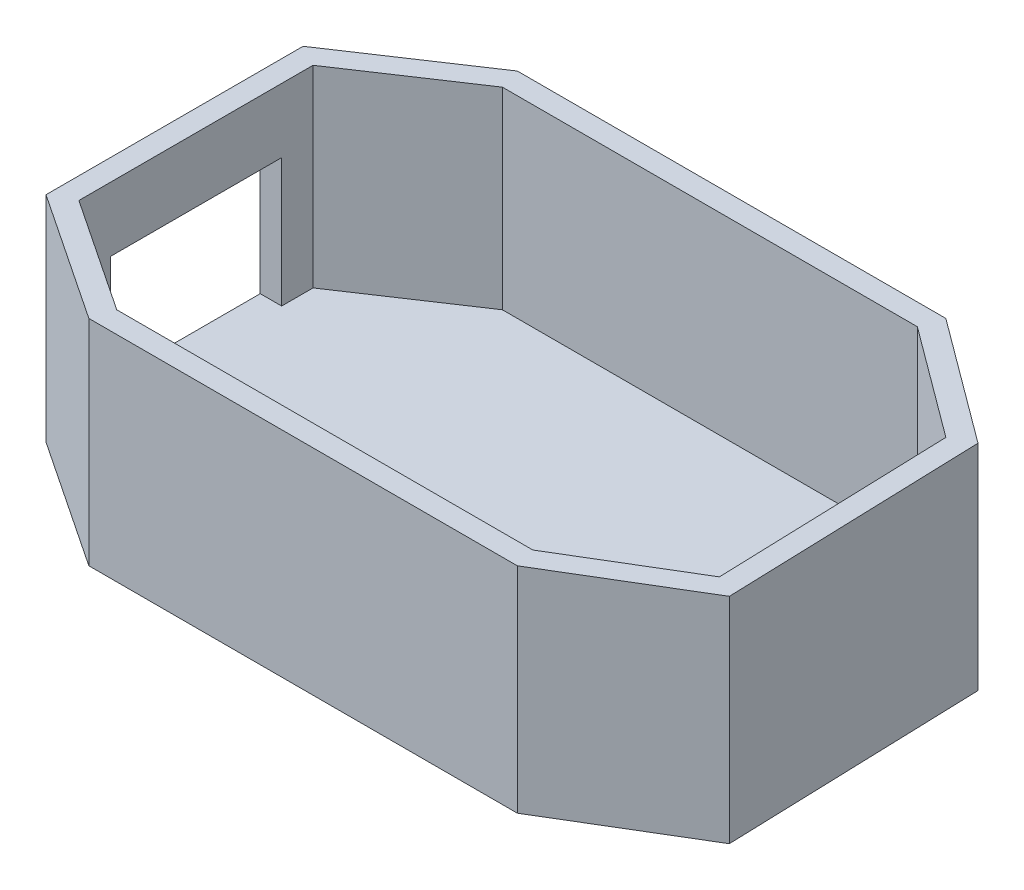
ISO-10303-21;
HEADER;
FILE_DESCRIPTION(('STEP AP214'),'2;1');
FILE_NAME('part.step','',(''),(''),'','','');
FILE_SCHEMA(('AUTOMOTIVE_DESIGN { 1 0 10303 214 1 1 1 1 }'));
ENDSEC;
DATA;
#1=APPLICATION_CONTEXT('core data for automotive mechanical design processes');
#2=APPLICATION_PROTOCOL_DEFINITION('international standard','automotive_design',2000,#1);
#3=PRODUCT_CONTEXT('',#1,'mechanical');
#4=PRODUCT('Part','Part','',(#3));
#5=PRODUCT_RELATED_PRODUCT_CATEGORY('part','',(#4));
#6=PRODUCT_DEFINITION_FORMATION('','',#4);
#7=PRODUCT_DEFINITION_CONTEXT('part definition',#1,'design');
#8=PRODUCT_DEFINITION('design','',#6,#7);
#9=PRODUCT_DEFINITION_SHAPE('','',#8);
#10=(LENGTH_UNIT() NAMED_UNIT(*) SI_UNIT(.MILLI.,.METRE.));
#11=(NAMED_UNIT(*) PLANE_ANGLE_UNIT() SI_UNIT($,.RADIAN.));
#12=(NAMED_UNIT(*) SI_UNIT($,.STERADIAN.) SOLID_ANGLE_UNIT());
#13=UNCERTAINTY_MEASURE_WITH_UNIT(LENGTH_MEASURE(1.E-05),#10,'distance_accuracy_value','');
#14=(GEOMETRIC_REPRESENTATION_CONTEXT(3) GLOBAL_UNCERTAINTY_ASSIGNED_CONTEXT((#13)) GLOBAL_UNIT_ASSIGNED_CONTEXT((#10,
#11,#12)) REPRESENTATION_CONTEXT('',''));
#15=CARTESIAN_POINT('',(0.,0.,0.));
#16=DIRECTION('',(0.,0.,1.));
#17=DIRECTION('',(1.,0.,0.));
#18=AXIS2_PLACEMENT_3D('',#15,#16,#17);
#19=CARTESIAN_POINT('',(0.,50.,0.));
#20=DIRECTION('',(0.,-1.,0.));
#21=DIRECTION('',(0.,0.,-1.));
#22=AXIS2_PLACEMENT_3D('',#19,#20,#21);
#23=PLANE('',#22);
#24=DIRECTION('',(-0.832050294337843,0.,0.55470019622523));
#25=VECTOR('',#24,1.);
#26=CARTESIAN_POINT('',(-60.,50.,-40.));
#27=LINE('',#26,#25);
#28=CARTESIAN_POINT('',(-60.,50.,-40.));
#29=VERTEX_POINT('',#28);
#30=CARTESIAN_POINT('',(-90.,50.,-20.));
#31=VERTEX_POINT('',#30);
#32=EDGE_CURVE('E268',#29,#31,#27,.T.);
#33=ORIENTED_EDGE('',*,*,#32,.T.);
#34=DIRECTION('',(0.,0.,1.));
#35=VECTOR('',#34,1.);
#36=CARTESIAN_POINT('',(-90.,50.,-20.));
#37=LINE('',#36,#35);
#38=CARTESIAN_POINT('',(-90.,50.,40.));
#39=VERTEX_POINT('',#38);
#40=EDGE_CURVE('E271',#31,#39,#37,.T.);
#41=ORIENTED_EDGE('',*,*,#40,.T.);
#42=DIRECTION('',(0.832050294337843,0.,0.554700196225229));
#43=VECTOR('',#42,1.);
#44=CARTESIAN_POINT('',(-90.,50.,40.));
#45=LINE('',#44,#43);
#46=CARTESIAN_POINT('',(-60.,50.,60.));
#47=VERTEX_POINT('',#46);
#48=EDGE_CURVE('E274',#39,#47,#45,.T.);
#49=ORIENTED_EDGE('',*,*,#48,.T.);
#50=DIRECTION('',(1.,0.,0.));
#51=VECTOR('',#50,1.);
#52=CARTESIAN_POINT('',(-60.,50.,60.));
#53=LINE('',#52,#51);
#54=CARTESIAN_POINT('',(40.,50.,60.));
#55=VERTEX_POINT('',#54);
#56=EDGE_CURVE('E276',#47,#55,#53,.T.);
#57=ORIENTED_EDGE('',*,*,#56,.T.);
#58=DIRECTION('',(0.857204895939187,0.,-0.514975500755024));
#59=VECTOR('',#58,1.);
#60=CARTESIAN_POINT('',(40.,50.,60.));
#61=LINE('',#60,#59);
#62=CARTESIAN_POINT('',(70.9069620588752,50.,41.4322942642002));
#63=VERTEX_POINT('',#62);
#64=EDGE_CURVE('E278',#55,#63,#61,.T.);
#65=ORIENTED_EDGE('',*,*,#64,.T.);
#66=DIRECTION('',(-0.0322666793552478,0.,-0.999479295134915));
#67=VECTOR('',#66,1.);
#68=CARTESIAN_POINT('',(70.9069620588752,50.,41.4322942642002));
#69=LINE('',#68,#67);
#70=CARTESIAN_POINT('',(68.9709612975603,50.,-18.5364634438947));
#71=VERTEX_POINT('',#70);
#72=EDGE_CURVE('E280',#63,#71,#69,.T.);
#73=ORIENTED_EDGE('',*,*,#72,.T.);
#74=DIRECTION('',(-0.80350989582951,0.,-0.595291396967947));
#75=VECTOR('',#74,1.);
#76=CARTESIAN_POINT('',(68.9709612975603,50.,-18.5364634438947));
#77=LINE('',#76,#75);
#78=CARTESIAN_POINT('',(40.,50.,-40.));
#79=VERTEX_POINT('',#78);
#80=EDGE_CURVE('E282',#71,#79,#77,.T.);
#81=ORIENTED_EDGE('',*,*,#80,.T.);
#82=DIRECTION('',(1.,0.,0.));
#83=VECTOR('',#82,1.);
#84=CARTESIAN_POINT('',(-60.,50.,-40.));
#85=LINE('',#84,#83);
#86=EDGE_CURVE('E284',#29,#79,#85,.T.);
#87=ORIENTED_EDGE('',*,*,#86,.F.);
#88=EDGE_LOOP('',(#33,#41,#49,#57,#65,#73,#81,#87));
#89=FACE_BOUND('',#88,.T.);
#90=DIRECTION('',(-0.832050294337843,0.,0.55470019622523));
#91=VECTOR('',#90,1.);
#92=CARTESIAN_POINT('',(-34.1495759419508,50.,-51.2243639129262));
#93=LINE('',#92,#91);
#94=CARTESIAN_POINT('',(-58.4861218113401,50.,-35.));
#95=VERTEX_POINT('',#94);
#96=CARTESIAN_POINT('',(-85.,50.,-17.32408120756));
#97=VERTEX_POINT('',#96);
#98=EDGE_CURVE('E251',#95,#97,#93,.T.);
#99=ORIENTED_EDGE('',*,*,#98,.F.);
#100=DIRECTION('',(1.,0.,0.));
#101=VECTOR('',#100,1.);
#102=CARTESIAN_POINT('',(0.,50.,-35.));
#103=LINE('',#102,#101);
#104=CARTESIAN_POINT('',(38.3496309104138,50.,-35.));
#105=VERTEX_POINT('',#104);
#106=EDGE_CURVE('E219',#95,#105,#103,.T.);
#107=ORIENTED_EDGE('',*,*,#106,.T.);
#108=DIRECTION('',(-0.80350989582951,0.,-0.595291396967947));
#109=VECTOR('',#108,1.);
#110=CARTESIAN_POINT('',(30.331318041959,50.,-40.9404777633272));
#111=LINE('',#110,#109);
#112=CARTESIAN_POINT('',(64.0515868776399,50.,-15.9583511641217));
#113=VERTEX_POINT('',#112);
#114=EDGE_CURVE('E263',#113,#105,#111,.T.);
#115=ORIENTED_EDGE('',*,*,#114,.F.);
#116=DIRECTION('',(-0.0322666793552478,0.,-0.999479295134915));
#117=VECTOR('',#116,1.);
#118=CARTESIAN_POINT('',(64.4995551755071,50.,-2.08227071389535));
#119=LINE('',#118,#117);
#120=CARTESIAN_POINT('',(65.8148110411914,50.,38.6585502141933));
#121=VERTEX_POINT('',#120);
#122=EDGE_CURVE('E261',#121,#113,#119,.T.);
#123=ORIENTED_EDGE('',*,*,#122,.F.);
#124=DIRECTION('',(0.857204895939187,0.,-0.514975500755024));
#125=VECTOR('',#124,1.);
#126=CARTESIAN_POINT('',(34.5194843834969,50.,57.4595703590685));
#127=LINE('',#126,#125);
#128=CARTESIAN_POINT('',(38.6135738122352,50.,55.));
#129=VERTEX_POINT('',#128);
#130=EDGE_CURVE('E259',#129,#121,#127,.T.);
#131=ORIENTED_EDGE('',*,*,#130,.F.);
#132=DIRECTION('',(1.,0.,0.));
#133=VECTOR('',#132,1.);
#134=CARTESIAN_POINT('',(0.,50.,55.));
#135=LINE('',#134,#133);
#136=CARTESIAN_POINT('',(-58.4861218113401,50.,55.));
#137=VERTEX_POINT('',#136);
#138=EDGE_CURVE('E257',#137,#129,#135,.T.);
#139=ORIENTED_EDGE('',*,*,#138,.F.);
#140=DIRECTION('',(0.832050294337844,0.,0.554700196225229));
#141=VECTOR('',#140,1.);
#142=CARTESIAN_POINT('',(-43.38034517272,50.,65.07051775908));
#143=LINE('',#142,#141);
#144=CARTESIAN_POINT('',(-85.,50.,37.32408120756));
#145=VERTEX_POINT('',#144);
#146=EDGE_CURVE('E255',#145,#137,#143,.T.);
#147=ORIENTED_EDGE('',*,*,#146,.F.);
#148=DIRECTION('',(0.,0.,1.));
#149=VECTOR('',#148,1.);
#150=CARTESIAN_POINT('',(-85.,50.,0.));
#151=LINE('',#150,#149);
#152=EDGE_CURVE('E253',#97,#145,#151,.T.);
#153=ORIENTED_EDGE('',*,*,#152,.F.);
#154=EDGE_LOOP('',(#99,#107,#115,#123,#131,#139,#147,#153));
#155=FACE_BOUND('',#154,.T.);
#156=ADVANCED_FACE('F35',(#89,#155),#23,.F.);
#157=CARTESIAN_POINT('',(-60.,50.,-40.));
#158=DIRECTION('',(0.55470019622523,0.,0.832050294337843));
#159=DIRECTION('',(0.832050294337843,0.,-0.55470019622523));
#160=AXIS2_PLACEMENT_3D('',#157,#158,#159);
#161=PLANE('',#160);
#162=DIRECTION('',(-0.832050294337843,0.,0.55470019622523));
#163=VECTOR('',#162,1.);
#164=CARTESIAN_POINT('',(-60.,0.,-40.));
#165=LINE('',#164,#163);
#166=CARTESIAN_POINT('',(-60.,0.,-40.));
#167=VERTEX_POINT('',#166);
#168=CARTESIAN_POINT('',(-90.,0.,-20.));
#169=VERTEX_POINT('',#168);
#170=EDGE_CURVE('E214',#167,#169,#165,.T.);
#171=ORIENTED_EDGE('',*,*,#170,.T.);
#172=DIRECTION('',(0.,-1.,0.));
#173=VECTOR('',#172,1.);
#174=CARTESIAN_POINT('',(-90.,50.,-20.));
#175=LINE('',#174,#173);
#176=EDGE_CURVE('E11',#31,#169,#175,.T.);
#177=ORIENTED_EDGE('',*,*,#176,.F.);
#178=ORIENTED_EDGE('',*,*,#32,.F.);
#179=DIRECTION('',(0.,-1.,0.));
#180=VECTOR('',#179,1.);
#181=CARTESIAN_POINT('',(-60.,50.,-40.));
#182=LINE('',#181,#180);
#183=EDGE_CURVE('E287',#29,#167,#182,.T.);
#184=ORIENTED_EDGE('',*,*,#183,.T.);
#185=EDGE_LOOP('',(#171,#177,#178,#184));
#186=FACE_BOUND('',#185,.T.);
#187=ADVANCED_FACE('F37',(#186),#161,.F.);
#188=CARTESIAN_POINT('',(-90.,50.,-20.));
#189=DIRECTION('',(1.,0.,0.));
#190=DIRECTION('',(0.,0.,-1.));
#191=AXIS2_PLACEMENT_3D('',#188,#189,#190);
#192=PLANE('',#191);
#193=DIRECTION('',(0.,0.,-1.));
#194=VECTOR('',#193,1.);
#195=CARTESIAN_POINT('',(-90.,35.,-9.99999999999999));
#196=LINE('',#195,#194);
#197=CARTESIAN_POINT('',(-90.,35.,30.));
#198=VERTEX_POINT('',#197);
#199=CARTESIAN_POINT('',(-90.,35.,-9.99999999999999));
#200=VERTEX_POINT('',#199);
#201=EDGE_CURVE('E187',#198,#200,#196,.T.);
#202=ORIENTED_EDGE('',*,*,#201,.F.);
#203=DIRECTION('',(0.,1.,0.));
#204=VECTOR('',#203,1.);
#205=CARTESIAN_POINT('',(-90.,35.,30.));
#206=LINE('',#205,#204);
#207=CARTESIAN_POINT('',(-90.,5.,30.));
#208=VERTEX_POINT('',#207);
#209=EDGE_CURVE('E50',#208,#198,#206,.T.);
#210=ORIENTED_EDGE('',*,*,#209,.F.);
#211=DIRECTION('',(0.,0.,1.));
#212=VECTOR('',#211,1.);
#213=CARTESIAN_POINT('',(-90.,5.00000000000001,-9.99999999999998));
#214=LINE('',#213,#212);
#215=CARTESIAN_POINT('',(-90.,5.00000000000001,-9.99999999999998));
#216=VERTEX_POINT('',#215);
#217=EDGE_CURVE('E197',#216,#208,#214,.T.);
#218=ORIENTED_EDGE('',*,*,#217,.F.);
#219=DIRECTION('',(0.,-1.,0.));
#220=VECTOR('',#219,1.);
#221=CARTESIAN_POINT('',(-90.,35.,-9.99999999999999));
#222=LINE('',#221,#220);
#223=EDGE_CURVE('E200',#200,#216,#222,.T.);
#224=ORIENTED_EDGE('',*,*,#223,.F.);
#225=EDGE_LOOP('',(#202,#210,#218,#224));
#226=FACE_BOUND('',#225,.T.);
#227=DIRECTION('',(0.,0.,1.));
#228=VECTOR('',#227,1.);
#229=CARTESIAN_POINT('',(-90.,0.,-20.));
#230=LINE('',#229,#228);
#231=CARTESIAN_POINT('',(-90.,0.,40.));
#232=VERTEX_POINT('',#231);
#233=EDGE_CURVE('E290',#169,#232,#230,.T.);
#234=ORIENTED_EDGE('',*,*,#233,.T.);
#235=DIRECTION('',(0.,-1.,0.));
#236=VECTOR('',#235,1.);
#237=CARTESIAN_POINT('',(-90.,50.,40.));
#238=LINE('',#237,#236);
#239=EDGE_CURVE('E43',#39,#232,#238,.T.);
#240=ORIENTED_EDGE('',*,*,#239,.F.);
#241=ORIENTED_EDGE('',*,*,#40,.F.);
#242=ORIENTED_EDGE('',*,*,#176,.T.);
#243=EDGE_LOOP('',(#234,#240,#241,#242));
#244=FACE_BOUND('',#243,.T.);
#245=ADVANCED_FACE('F348',(#226,#244),#192,.F.);
#246=CARTESIAN_POINT('',(-90.,50.,40.));
#247=DIRECTION('',(0.554700196225229,0.,-0.832050294337843));
#248=DIRECTION('',(-0.832050294337844,0.,-0.554700196225229));
#249=AXIS2_PLACEMENT_3D('',#246,#247,#248);
#250=PLANE('',#249);
#251=DIRECTION('',(0.832050294337843,0.,0.554700196225229));
#252=VECTOR('',#251,1.);
#253=CARTESIAN_POINT('',(-90.,0.,40.));
#254=LINE('',#253,#252);
#255=CARTESIAN_POINT('',(-60.,0.,60.));
#256=VERTEX_POINT('',#255);
#257=EDGE_CURVE('E292',#232,#256,#254,.T.);
#258=ORIENTED_EDGE('',*,*,#257,.T.);
#259=DIRECTION('',(0.,-1.,0.));
#260=VECTOR('',#259,1.);
#261=CARTESIAN_POINT('',(-60.,50.,60.));
#262=LINE('',#261,#260);
#263=EDGE_CURVE('E317',#47,#256,#262,.T.);
#264=ORIENTED_EDGE('',*,*,#263,.F.);
#265=ORIENTED_EDGE('',*,*,#48,.F.);
#266=ORIENTED_EDGE('',*,*,#239,.T.);
#267=EDGE_LOOP('',(#258,#264,#265,#266));
#268=FACE_BOUND('',#267,.T.);
#269=ADVANCED_FACE('F324',(#268),#250,.F.);
#270=CARTESIAN_POINT('',(-60.,50.,60.));
#271=DIRECTION('',(0.,0.,-1.));
#272=DIRECTION('',(-1.,0.,0.));
#273=AXIS2_PLACEMENT_3D('',#270,#271,#272);
#274=PLANE('',#273);
#275=DIRECTION('',(1.,0.,0.));
#276=VECTOR('',#275,1.);
#277=CARTESIAN_POINT('',(-60.,0.,60.));
#278=LINE('',#277,#276);
#279=CARTESIAN_POINT('',(40.,0.,60.));
#280=VERTEX_POINT('',#279);
#281=EDGE_CURVE('E294',#256,#280,#278,.T.);
#282=ORIENTED_EDGE('',*,*,#281,.T.);
#283=DIRECTION('',(0.,-1.,0.));
#284=VECTOR('',#283,1.);
#285=CARTESIAN_POINT('',(40.,50.,60.));
#286=LINE('',#285,#284);
#287=EDGE_CURVE('E314',#55,#280,#286,.T.);
#288=ORIENTED_EDGE('',*,*,#287,.F.);
#289=ORIENTED_EDGE('',*,*,#56,.F.);
#290=ORIENTED_EDGE('',*,*,#263,.T.);
#291=EDGE_LOOP('',(#282,#288,#289,#290));
#292=FACE_BOUND('',#291,.T.);
#293=ADVANCED_FACE('F335',(#292),#274,.F.);
#294=CARTESIAN_POINT('',(40.,50.,60.));
#295=DIRECTION('',(-0.514975500755024,0.,-0.857204895939187));
#296=DIRECTION('',(-0.857204895939187,0.,0.514975500755024));
#297=AXIS2_PLACEMENT_3D('',#294,#295,#296);
#298=PLANE('',#297);
#299=DIRECTION('',(0.857204895939187,0.,-0.514975500755024));
#300=VECTOR('',#299,1.);
#301=CARTESIAN_POINT('',(40.,0.,60.));
#302=LINE('',#301,#300);
#303=CARTESIAN_POINT('',(70.9069620588752,0.,41.4322942642002));
#304=VERTEX_POINT('',#303);
#305=EDGE_CURVE('E296',#280,#304,#302,.T.);
#306=ORIENTED_EDGE('',*,*,#305,.T.);
#307=DIRECTION('',(0.,-1.,0.));
#308=VECTOR('',#307,1.);
#309=CARTESIAN_POINT('',(70.9069620588752,50.,41.4322942642002));
#310=LINE('',#309,#308);
#311=EDGE_CURVE('E311',#63,#304,#310,.T.);
#312=ORIENTED_EDGE('',*,*,#311,.F.);
#313=ORIENTED_EDGE('',*,*,#64,.F.);
#314=ORIENTED_EDGE('',*,*,#287,.T.);
#315=EDGE_LOOP('',(#306,#312,#313,#314));
#316=FACE_BOUND('',#315,.T.);
#317=ADVANCED_FACE('F339',(#316),#298,.F.);
#318=CARTESIAN_POINT('',(70.9069620588752,50.,41.4322942642002));
#319=DIRECTION('',(-0.999479295134915,0.,0.0322666793552478));
#320=DIRECTION('',(0.0322666793552478,0.,0.999479295134915));
#321=AXIS2_PLACEMENT_3D('',#318,#319,#320);
#322=PLANE('',#321);
#323=DIRECTION('',(-0.0322666793552478,0.,-0.999479295134915));
#324=VECTOR('',#323,1.);
#325=CARTESIAN_POINT('',(70.9069620588752,0.,41.4322942642002));
#326=LINE('',#325,#324);
#327=CARTESIAN_POINT('',(68.9709612975603,0.,-18.5364634438947));
#328=VERTEX_POINT('',#327);
#329=EDGE_CURVE('E298',#304,#328,#326,.T.);
#330=ORIENTED_EDGE('',*,*,#329,.T.);
#331=DIRECTION('',(0.,-1.,0.));
#332=VECTOR('',#331,1.);
#333=CARTESIAN_POINT('',(68.9709612975603,50.,-18.5364634438947));
#334=LINE('',#333,#332);
#335=EDGE_CURVE('E308',#71,#328,#334,.T.);
#336=ORIENTED_EDGE('',*,*,#335,.F.);
#337=ORIENTED_EDGE('',*,*,#72,.F.);
#338=ORIENTED_EDGE('',*,*,#311,.T.);
#339=EDGE_LOOP('',(#330,#336,#337,#338));
#340=FACE_BOUND('',#339,.T.);
#341=ADVANCED_FACE('F359',(#340),#322,.F.);
#342=CARTESIAN_POINT('',(68.9709612975603,50.,-18.5364634438947));
#343=DIRECTION('',(-0.595291396967947,0.,0.80350989582951));
#344=DIRECTION('',(0.80350989582951,0.,0.595291396967947));
#345=AXIS2_PLACEMENT_3D('',#342,#343,#344);
#346=PLANE('',#345);
#347=DIRECTION('',(-0.80350989582951,0.,-0.595291396967947));
#348=VECTOR('',#347,1.);
#349=CARTESIAN_POINT('',(68.9709612975603,0.,-18.5364634438947));
#350=LINE('',#349,#348);
#351=CARTESIAN_POINT('',(40.,0.,-40.));
#352=VERTEX_POINT('',#351);
#353=EDGE_CURVE('E300',#328,#352,#350,.T.);
#354=ORIENTED_EDGE('',*,*,#353,.T.);
#355=DIRECTION('',(0.,-1.,0.));
#356=VECTOR('',#355,1.);
#357=CARTESIAN_POINT('',(40.,50.,-40.));
#358=LINE('',#357,#356);
#359=EDGE_CURVE('E306',#79,#352,#358,.T.);
#360=ORIENTED_EDGE('',*,*,#359,.F.);
#361=ORIENTED_EDGE('',*,*,#80,.F.);
#362=ORIENTED_EDGE('',*,*,#335,.T.);
#363=EDGE_LOOP('',(#354,#360,#361,#362));
#364=FACE_BOUND('',#363,.T.);
#365=ADVANCED_FACE('F357',(#364),#346,.F.);
#366=CARTESIAN_POINT('',(-60.,50.,-40.));
#367=DIRECTION('',(0.,0.,-1.));
#368=DIRECTION('',(-1.,0.,0.));
#369=AXIS2_PLACEMENT_3D('',#366,#367,#368);
#370=PLANE('',#369);
#371=DIRECTION('',(1.,0.,0.));
#372=VECTOR('',#371,1.);
#373=CARTESIAN_POINT('',(-60.,0.,-40.));
#374=LINE('',#373,#372);
#375=EDGE_CURVE('E272',#167,#352,#374,.T.);
#376=ORIENTED_EDGE('',*,*,#375,.F.);
#377=ORIENTED_EDGE('',*,*,#183,.F.);
#378=ORIENTED_EDGE('',*,*,#86,.T.);
#379=ORIENTED_EDGE('',*,*,#359,.T.);
#380=EDGE_LOOP('',(#376,#377,#378,#379));
#381=FACE_BOUND('',#380,.T.);
#382=ADVANCED_FACE('F353',(#381),#370,.T.);
#383=CARTESIAN_POINT('',(0.,0.,0.));
#384=DIRECTION('',(0.,-1.,0.));
#385=DIRECTION('',(0.,0.,-1.));
#386=AXIS2_PLACEMENT_3D('',#383,#384,#385);
#387=PLANE('',#386);
#388=ORIENTED_EDGE('',*,*,#170,.F.);
#389=ORIENTED_EDGE('',*,*,#375,.T.);
#390=ORIENTED_EDGE('',*,*,#353,.F.);
#391=ORIENTED_EDGE('',*,*,#329,.F.);
#392=ORIENTED_EDGE('',*,*,#305,.F.);
#393=ORIENTED_EDGE('',*,*,#281,.F.);
#394=ORIENTED_EDGE('',*,*,#257,.F.);
#395=ORIENTED_EDGE('',*,*,#233,.F.);
#396=EDGE_LOOP('',(#388,#389,#390,#391,#392,#393,#394,#395));
#397=FACE_BOUND('',#396,.T.);
#398=ADVANCED_FACE('F330',(#397),#387,.T.);
#399=CARTESIAN_POINT('',(-57.2264990188739,50.,-35.8397485283108));
#400=DIRECTION('',(0.55470019622523,0.,0.832050294337843));
#401=DIRECTION('',(0.832050294337843,0.,-0.55470019622523));
#402=AXIS2_PLACEMENT_3D('',#399,#400,#401);
#403=PLANE('',#402);
#404=DIRECTION('',(-0.832050294337843,0.,0.55470019622523));
#405=VECTOR('',#404,1.);
#406=CARTESIAN_POINT('',(-34.1495759419508,5.,-51.2243639129262));
#407=LINE('',#406,#405);
#408=CARTESIAN_POINT('',(-58.4861218113401,5.,-35.));
#409=VERTEX_POINT('',#408);
#410=CARTESIAN_POINT('',(-85.,5.,-17.32408120756));
#411=VERTEX_POINT('',#410);
#412=EDGE_CURVE('E199',#409,#411,#407,.T.);
#413=ORIENTED_EDGE('',*,*,#412,.F.);
#414=DIRECTION('',(0.,-1.,0.));
#415=VECTOR('',#414,1.);
#416=CARTESIAN_POINT('',(-58.4861218113401,50.,-35.));
#417=LINE('',#416,#415);
#418=EDGE_CURVE('E216',#95,#409,#417,.T.);
#419=ORIENTED_EDGE('',*,*,#418,.F.);
#420=ORIENTED_EDGE('',*,*,#98,.T.);
#421=DIRECTION('',(0.,-1.,0.));
#422=VECTOR('',#421,1.);
#423=CARTESIAN_POINT('',(-85.,50.,-17.32408120756));
#424=LINE('',#423,#422);
#425=EDGE_CURVE('E211',#97,#411,#424,.T.);
#426=ORIENTED_EDGE('',*,*,#425,.T.);
#427=EDGE_LOOP('',(#413,#419,#420,#426));
#428=FACE_BOUND('',#427,.T.);
#429=ADVANCED_FACE('F379',(#428),#403,.T.);
#430=CARTESIAN_POINT('',(-85.,50.,-20.));
#431=DIRECTION('',(1.,0.,0.));
#432=DIRECTION('',(0.,0.,-1.));
#433=AXIS2_PLACEMENT_3D('',#430,#431,#432);
#434=PLANE('',#433);
#435=DIRECTION('',(0.,1.,0.));
#436=VECTOR('',#435,1.);
#437=CARTESIAN_POINT('',(-85.,35.,30.));
#438=LINE('',#437,#436);
#439=CARTESIAN_POINT('',(-85.,5.,30.0000000000001));
#440=VERTEX_POINT('',#439);
#441=CARTESIAN_POINT('',(-85.,35.,30.0000000000001));
#442=VERTEX_POINT('',#441);
#443=EDGE_CURVE('E193',#440,#442,#438,.T.);
#444=ORIENTED_EDGE('',*,*,#443,.T.);
#445=DIRECTION('',(0.,0.,-1.));
#446=VECTOR('',#445,1.);
#447=CARTESIAN_POINT('',(-85.,35.,-9.99999999999999));
#448=LINE('',#447,#446);
#449=CARTESIAN_POINT('',(-85.,35.,-9.99999999999999));
#450=VERTEX_POINT('',#449);
#451=EDGE_CURVE('E185',#442,#450,#448,.T.);
#452=ORIENTED_EDGE('',*,*,#451,.T.);
#453=DIRECTION('',(0.,-1.,0.));
#454=VECTOR('',#453,1.);
#455=CARTESIAN_POINT('',(-85.,35.,-9.99999999999999));
#456=LINE('',#455,#454);
#457=CARTESIAN_POINT('',(-85.,5.,-9.99999999999995));
#458=VERTEX_POINT('',#457);
#459=EDGE_CURVE('E172',#450,#458,#456,.T.);
#460=ORIENTED_EDGE('',*,*,#459,.T.);
#461=DIRECTION('',(0.,0.,1.));
#462=VECTOR('',#461,1.);
#463=CARTESIAN_POINT('',(-85.,5.,0.));
#464=LINE('',#463,#462);
#465=EDGE_CURVE('E220',#411,#458,#464,.T.);
#466=ORIENTED_EDGE('',*,*,#465,.F.);
#467=ORIENTED_EDGE('',*,*,#425,.F.);
#468=ORIENTED_EDGE('',*,*,#152,.T.);
#469=DIRECTION('',(0.,-1.,0.));
#470=VECTOR('',#469,1.);
#471=CARTESIAN_POINT('',(-85.,50.,37.32408120756));
#472=LINE('',#471,#470);
#473=CARTESIAN_POINT('',(-85.,5.,37.32408120756));
#474=VERTEX_POINT('',#473);
#475=EDGE_CURVE('E215',#145,#474,#472,.T.);
#476=ORIENTED_EDGE('',*,*,#475,.T.);
#477=EDGE_CURVE('E210',#440,#474,#464,.T.);
#478=ORIENTED_EDGE('',*,*,#477,.F.);
#479=EDGE_LOOP('',(#444,#452,#460,#466,#467,#468,#476,#478));
#480=FACE_BOUND('',#479,.T.);
#481=ADVANCED_FACE('F191',(#480),#434,.T.);
#482=CARTESIAN_POINT('',(-87.2264990188739,50.,35.8397485283108));
#483=DIRECTION('',(0.554700196225229,0.,-0.832050294337843));
#484=DIRECTION('',(-0.832050294337844,0.,-0.554700196225229));
#485=AXIS2_PLACEMENT_3D('',#482,#483,#484);
#486=PLANE('',#485);
#487=DIRECTION('',(0.832050294337844,0.,0.554700196225229));
#488=VECTOR('',#487,1.);
#489=CARTESIAN_POINT('',(-43.38034517272,5.,65.07051775908));
#490=LINE('',#489,#488);
#491=CARTESIAN_POINT('',(-58.4861218113401,5.,55.));
#492=VERTEX_POINT('',#491);
#493=EDGE_CURVE('E222',#474,#492,#490,.T.);
#494=ORIENTED_EDGE('',*,*,#493,.F.);
#495=ORIENTED_EDGE('',*,*,#475,.F.);
#496=ORIENTED_EDGE('',*,*,#146,.T.);
#497=DIRECTION('',(0.,-1.,0.));
#498=VECTOR('',#497,1.);
#499=CARTESIAN_POINT('',(-58.4861218113401,50.,55.));
#500=LINE('',#499,#498);
#501=EDGE_CURVE('E225',#137,#492,#500,.T.);
#502=ORIENTED_EDGE('',*,*,#501,.T.);
#503=EDGE_LOOP('',(#494,#495,#496,#502));
#504=FACE_BOUND('',#503,.T.);
#505=ADVANCED_FACE('F403',(#504),#486,.T.);
#506=CARTESIAN_POINT('',(-60.,50.,55.));
#507=DIRECTION('',(0.,0.,-1.));
#508=DIRECTION('',(-1.,0.,0.));
#509=AXIS2_PLACEMENT_3D('',#506,#507,#508);
#510=PLANE('',#509);
#511=DIRECTION('',(1.,0.,0.));
#512=VECTOR('',#511,1.);
#513=CARTESIAN_POINT('',(0.,5.,55.));
#514=LINE('',#513,#512);
#515=CARTESIAN_POINT('',(38.6135738122352,5.,55.));
#516=VERTEX_POINT('',#515);
#517=EDGE_CURVE('E227',#492,#516,#514,.T.);
#518=ORIENTED_EDGE('',*,*,#517,.F.);
#519=ORIENTED_EDGE('',*,*,#501,.F.);
#520=ORIENTED_EDGE('',*,*,#138,.T.);
#521=DIRECTION('',(0.,-1.,0.));
#522=VECTOR('',#521,1.);
#523=CARTESIAN_POINT('',(38.6135738122352,50.,55.));
#524=LINE('',#523,#522);
#525=EDGE_CURVE('E230',#129,#516,#524,.T.);
#526=ORIENTED_EDGE('',*,*,#525,.T.);
#527=EDGE_LOOP('',(#518,#519,#520,#526));
#528=FACE_BOUND('',#527,.T.);
#529=ADVANCED_FACE('F411',(#528),#510,.T.);
#530=CARTESIAN_POINT('',(37.4251224962249,50.,55.7139755203041));
#531=DIRECTION('',(-0.514975500755024,0.,-0.857204895939187));
#532=DIRECTION('',(-0.857204895939187,0.,0.514975500755024));
#533=AXIS2_PLACEMENT_3D('',#530,#531,#532);
#534=PLANE('',#533);
#535=DIRECTION('',(0.857204895939187,0.,-0.514975500755024));
#536=VECTOR('',#535,1.);
#537=CARTESIAN_POINT('',(34.5194843834969,5.,57.4595703590685));
#538=LINE('',#537,#536);
#539=CARTESIAN_POINT('',(65.8148110411914,5.,38.6585502141933));
#540=VERTEX_POINT('',#539);
#541=EDGE_CURVE('E232',#516,#540,#538,.T.);
#542=ORIENTED_EDGE('',*,*,#541,.F.);
#543=ORIENTED_EDGE('',*,*,#525,.F.);
#544=ORIENTED_EDGE('',*,*,#130,.T.);
#545=DIRECTION('',(0.,-1.,0.));
#546=VECTOR('',#545,1.);
#547=CARTESIAN_POINT('',(65.8148110411914,50.,38.6585502141933));
#548=LINE('',#547,#546);
#549=EDGE_CURVE('E235',#121,#540,#548,.T.);
#550=ORIENTED_EDGE('',*,*,#549,.T.);
#551=EDGE_LOOP('',(#542,#543,#544,#550));
#552=FACE_BOUND('',#551,.T.);
#553=ADVANCED_FACE('F419',(#552),#534,.T.);
#554=CARTESIAN_POINT('',(65.9095655832006,50.,41.5936276609764));
#555=DIRECTION('',(-0.999479295134915,0.,0.0322666793552478));
#556=DIRECTION('',(0.0322666793552478,0.,0.999479295134915));
#557=AXIS2_PLACEMENT_3D('',#554,#555,#556);
#558=PLANE('',#557);
#559=DIRECTION('',(-0.0322666793552478,0.,-0.999479295134915));
#560=VECTOR('',#559,1.);
#561=CARTESIAN_POINT('',(64.4995551755071,5.,-2.08227071389535));
#562=LINE('',#561,#560);
#563=CARTESIAN_POINT('',(64.0515868776399,5.,-15.9583511641217));
#564=VERTEX_POINT('',#563);
#565=EDGE_CURVE('E237',#540,#564,#562,.T.);
#566=ORIENTED_EDGE('',*,*,#565,.F.);
#567=ORIENTED_EDGE('',*,*,#549,.F.);
#568=ORIENTED_EDGE('',*,*,#122,.T.);
#569=DIRECTION('',(0.,-1.,0.));
#570=VECTOR('',#569,1.);
#571=CARTESIAN_POINT('',(64.0515868776399,50.,-15.9583511641217));
#572=LINE('',#571,#570);
#573=EDGE_CURVE('E240',#113,#564,#572,.T.);
#574=ORIENTED_EDGE('',*,*,#573,.T.);
#575=EDGE_LOOP('',(#566,#567,#568,#574));
#576=FACE_BOUND('',#575,.T.);
#577=ADVANCED_FACE('F427',(#576),#558,.T.);
#578=CARTESIAN_POINT('',(65.9945043127206,50.,-14.5189139647472));
#579=DIRECTION('',(-0.595291396967947,0.,0.80350989582951));
#580=DIRECTION('',(0.80350989582951,0.,0.595291396967947));
#581=AXIS2_PLACEMENT_3D('',#578,#579,#580);
#582=PLANE('',#581);
#583=DIRECTION('',(-0.80350989582951,0.,-0.595291396967947));
#584=VECTOR('',#583,1.);
#585=CARTESIAN_POINT('',(30.331318041959,5.,-40.9404777633272));
#586=LINE('',#585,#584);
#587=CARTESIAN_POINT('',(38.3496309104138,5.,-35.));
#588=VERTEX_POINT('',#587);
#589=EDGE_CURVE('E242',#564,#588,#586,.T.);
#590=ORIENTED_EDGE('',*,*,#589,.F.);
#591=ORIENTED_EDGE('',*,*,#573,.F.);
#592=ORIENTED_EDGE('',*,*,#114,.T.);
#593=DIRECTION('',(0.,-1.,0.));
#594=VECTOR('',#593,1.);
#595=CARTESIAN_POINT('',(38.3496309104138,50.,-35.));
#596=LINE('',#595,#594);
#597=EDGE_CURVE('E218',#105,#588,#596,.T.);
#598=ORIENTED_EDGE('',*,*,#597,.T.);
#599=EDGE_LOOP('',(#590,#591,#592,#598));
#600=FACE_BOUND('',#599,.T.);
#601=ADVANCED_FACE('F435',(#600),#582,.T.);
#602=CARTESIAN_POINT('',(-60.,50.,-35.));
#603=DIRECTION('',(0.,0.,-1.));
#604=DIRECTION('',(-1.,0.,0.));
#605=AXIS2_PLACEMENT_3D('',#602,#603,#604);
#606=PLANE('',#605);
#607=DIRECTION('',(1.,0.,0.));
#608=VECTOR('',#607,1.);
#609=CARTESIAN_POINT('',(0.,5.,-35.));
#610=LINE('',#609,#608);
#611=EDGE_CURVE('E247',#409,#588,#610,.T.);
#612=ORIENTED_EDGE('',*,*,#611,.T.);
#613=ORIENTED_EDGE('',*,*,#597,.F.);
#614=ORIENTED_EDGE('',*,*,#106,.F.);
#615=ORIENTED_EDGE('',*,*,#418,.T.);
#616=EDGE_LOOP('',(#612,#613,#614,#615));
#617=FACE_BOUND('',#616,.T.);
#618=ADVANCED_FACE('F443',(#617),#606,.F.);
#619=CARTESIAN_POINT('',(0.,5.,0.));
#620=DIRECTION('',(0.,-1.,0.));
#621=DIRECTION('',(0.,0.,-1.));
#622=AXIS2_PLACEMENT_3D('',#619,#620,#621);
#623=PLANE('',#622);
#624=ORIENTED_EDGE('',*,*,#412,.T.);
#625=ORIENTED_EDGE('',*,*,#465,.T.);
#626=DIRECTION('',(-1.,0.,0.));
#627=VECTOR('',#626,1.);
#628=CARTESIAN_POINT('',(70.9079620588752,5.00000000000001,-9.99999999999991));
#629=LINE('',#628,#627);
#630=EDGE_CURVE('E178',#458,#216,#629,.T.);
#631=ORIENTED_EDGE('',*,*,#630,.T.);
#632=ORIENTED_EDGE('',*,*,#217,.T.);
#633=DIRECTION('',(-1.,0.,0.));
#634=VECTOR('',#633,1.);
#635=CARTESIAN_POINT('',(70.9079620588752,5.,30.0000000000001));
#636=LINE('',#635,#634);
#637=EDGE_CURVE('E57',#440,#208,#636,.T.);
#638=ORIENTED_EDGE('',*,*,#637,.F.);
#639=ORIENTED_EDGE('',*,*,#477,.T.);
#640=ORIENTED_EDGE('',*,*,#493,.T.);
#641=ORIENTED_EDGE('',*,*,#517,.T.);
#642=ORIENTED_EDGE('',*,*,#541,.T.);
#643=ORIENTED_EDGE('',*,*,#565,.T.);
#644=ORIENTED_EDGE('',*,*,#589,.T.);
#645=ORIENTED_EDGE('',*,*,#611,.F.);
#646=EDGE_LOOP('',(#624,#625,#631,#632,#638,#639,#640,#641,#642,#643,#644,#645));
#647=FACE_BOUND('',#646,.T.);
#648=ADVANCED_FACE('F375',(#647),#623,.F.);
#649=CARTESIAN_POINT('',(70.9079620588752,35.,30.0000000000001));
#650=DIRECTION('',(0.,0.,1.));
#651=DIRECTION('',(1.,0.,0.));
#652=AXIS2_PLACEMENT_3D('',#649,#650,#651);
#653=PLANE('',#652);
#654=ORIENTED_EDGE('',*,*,#637,.T.);
#655=ORIENTED_EDGE('',*,*,#209,.T.);
#656=DIRECTION('',(-1.,0.,0.));
#657=VECTOR('',#656,1.);
#658=CARTESIAN_POINT('',(70.9079620588752,35.,30.0000000000001));
#659=LINE('',#658,#657);
#660=EDGE_CURVE('E204',#442,#198,#659,.T.);
#661=ORIENTED_EDGE('',*,*,#660,.F.);
#662=ORIENTED_EDGE('',*,*,#443,.F.);
#663=EDGE_LOOP('',(#654,#655,#661,#662));
#664=FACE_BOUND('',#663,.T.);
#665=ADVANCED_FACE('F456',(#664),#653,.F.);
#666=CARTESIAN_POINT('',(70.9079620588752,35.,-9.99999999999991));
#667=DIRECTION('',(0.,0.,-1.));
#668=DIRECTION('',(-1.,0.,0.));
#669=AXIS2_PLACEMENT_3D('',#666,#667,#668);
#670=PLANE('',#669);
#671=DIRECTION('',(-1.,0.,0.));
#672=VECTOR('',#671,1.);
#673=CARTESIAN_POINT('',(70.9079620588752,35.,-9.99999999999991));
#674=LINE('',#673,#672);
#675=EDGE_CURVE('E176',#450,#200,#674,.T.);
#676=ORIENTED_EDGE('',*,*,#675,.T.);
#677=ORIENTED_EDGE('',*,*,#223,.T.);
#678=ORIENTED_EDGE('',*,*,#630,.F.);
#679=ORIENTED_EDGE('',*,*,#459,.F.);
#680=EDGE_LOOP('',(#676,#677,#678,#679));
#681=FACE_BOUND('',#680,.T.);
#682=ADVANCED_FACE('F174',(#681),#670,.F.);
#683=CARTESIAN_POINT('',(70.9079620588752,35.,-9.99999999999991));
#684=DIRECTION('',(0.,1.,0.));
#685=DIRECTION('',(0.,0.,1.));
#686=AXIS2_PLACEMENT_3D('',#683,#684,#685);
#687=PLANE('',#686);
#688=ORIENTED_EDGE('',*,*,#660,.T.);
#689=ORIENTED_EDGE('',*,*,#201,.T.);
#690=ORIENTED_EDGE('',*,*,#675,.F.);
#691=ORIENTED_EDGE('',*,*,#451,.F.);
#692=EDGE_LOOP('',(#688,#689,#690,#691));
#693=FACE_BOUND('',#692,.T.);
#694=ADVANCED_FACE('F184',(#693),#687,.F.);
#695=CLOSED_SHELL('',(#156,#187,#245,#269,#293,#317,#341,#365,#382,#398,#429,#481,#505,#529,
#553,#577,#601,#618,#648,#665,#682,#694));
#696=MANIFOLD_SOLID_BREP('B2',#695);
#697=ADVANCED_BREP_SHAPE_REPRESENTATION('',(#18,#696),#14);
#698=SHAPE_DEFINITION_REPRESENTATION(#9,#697);
ENDSEC;
END-ISO-10303-21;
